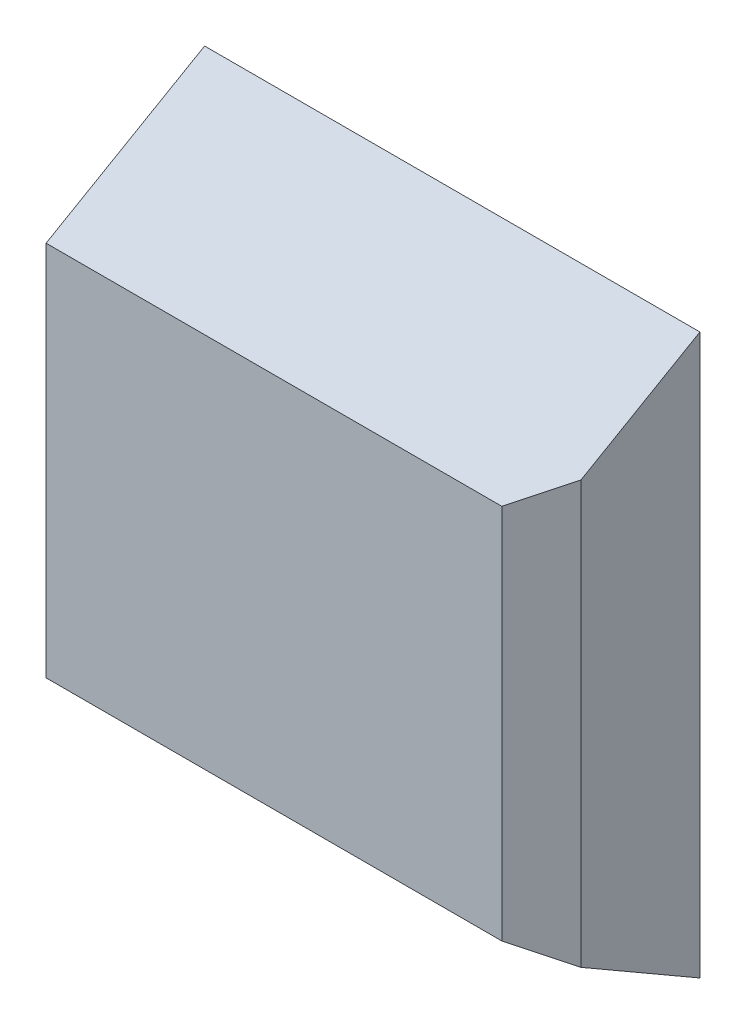
ISO-10303-21;
HEADER;
FILE_DESCRIPTION(('STEP AP214'),'2;1');
FILE_NAME('part.step','',(''),(''),'','','');
FILE_SCHEMA(('AUTOMOTIVE_DESIGN { 1 0 10303 214 1 1 1 1 }'));
ENDSEC;
DATA;
#1=APPLICATION_CONTEXT('core data for automotive mechanical design processes');
#2=APPLICATION_PROTOCOL_DEFINITION('international standard','automotive_design',2000,#1);
#3=PRODUCT_CONTEXT('',#1,'mechanical');
#4=PRODUCT('Part','Part','',(#3));
#5=PRODUCT_RELATED_PRODUCT_CATEGORY('part','',(#4));
#6=PRODUCT_DEFINITION_FORMATION('','',#4);
#7=PRODUCT_DEFINITION_CONTEXT('part definition',#1,'design');
#8=PRODUCT_DEFINITION('design','',#6,#7);
#9=PRODUCT_DEFINITION_SHAPE('','',#8);
#10=(LENGTH_UNIT() NAMED_UNIT(*) SI_UNIT(.MILLI.,.METRE.));
#11=(NAMED_UNIT(*) PLANE_ANGLE_UNIT() SI_UNIT($,.RADIAN.));
#12=(NAMED_UNIT(*) SI_UNIT($,.STERADIAN.) SOLID_ANGLE_UNIT());
#13=UNCERTAINTY_MEASURE_WITH_UNIT(LENGTH_MEASURE(1.E-05),#10,'distance_accuracy_value','');
#14=(GEOMETRIC_REPRESENTATION_CONTEXT(3) GLOBAL_UNCERTAINTY_ASSIGNED_CONTEXT((#13)) GLOBAL_UNIT_ASSIGNED_CONTEXT((#10,
#11,#12)) REPRESENTATION_CONTEXT('',''));
#15=CARTESIAN_POINT('',(0.,0.,0.));
#16=DIRECTION('',(0.,0.,1.));
#17=DIRECTION('',(1.,0.,0.));
#18=AXIS2_PLACEMENT_3D('',#15,#16,#17);
#19=CARTESIAN_POINT('',(12.5,14.118802153517,0.));
#20=DIRECTION('',(0.,0.86602540378444,0.499999999999997));
#21=DIRECTION('',(0.,-0.499999999999997,0.86602540378444));
#22=AXIS2_PLACEMENT_3D('',#19,#20,#21);
#23=PLANE('',#22);
#24=DIRECTION('',(-1.,0.,0.));
#25=VECTOR('',#24,1.);
#26=CARTESIAN_POINT('',(0.,11.8094010767585,4.));
#27=LINE('',#26,#25);
#28=CARTESIAN_POINT('',(11.5,11.8094010767585,4.));
#29=VERTEX_POINT('',#28);
#30=CARTESIAN_POINT('',(0.,11.8094010767585,4.));
#31=VERTEX_POINT('',#30);
#32=EDGE_CURVE('E115',#29,#31,#27,.T.);
#33=ORIENTED_EDGE('',*,*,#32,.F.);
#34=DIRECTION('',(-0.654653670707975,-0.377964473009226,0.65465367070798));
#35=VECTOR('',#34,1.);
#36=CARTESIAN_POINT('',(14.2142857142857,13.3764946645589,1.28571428571427));
#37=LINE('',#36,#35);
#38=CARTESIAN_POINT('',(12.5,12.3867513459481,2.99999999999999));
#39=VERTEX_POINT('',#38);
#40=EDGE_CURVE('E62',#29,#39,#37,.F.);
#41=ORIENTED_EDGE('',*,*,#40,.T.);
#42=DIRECTION('',(0.,-0.499999999999997,0.86602540378444));
#43=VECTOR('',#42,1.);
#44=CARTESIAN_POINT('',(12.5,10.5891016151378,6.11362066797605));
#45=LINE('',#44,#43);
#46=CARTESIAN_POINT('',(12.5,14.118802153517,0.));
#47=VERTEX_POINT('',#46);
#48=EDGE_CURVE('E106',#47,#39,#45,.T.);
#49=ORIENTED_EDGE('',*,*,#48,.F.);
#50=DIRECTION('',(-1.,0.,0.));
#51=VECTOR('',#50,1.);
#52=CARTESIAN_POINT('',(12.5,14.118802153517,0.));
#53=LINE('',#52,#51);
#54=CARTESIAN_POINT('',(0.,14.118802153517,0.));
#55=VERTEX_POINT('',#54);
#56=EDGE_CURVE('E101',#47,#55,#53,.T.);
#57=ORIENTED_EDGE('',*,*,#56,.T.);
#58=DIRECTION('',(0.,-0.499999999999997,0.86602540378444));
#59=VECTOR('',#58,1.);
#60=CARTESIAN_POINT('',(0.,14.118802153517,0.));
#61=LINE('',#60,#59);
#62=EDGE_CURVE('E86',#55,#31,#61,.T.);
#63=ORIENTED_EDGE('',*,*,#62,.T.);
#64=EDGE_LOOP('',(#33,#41,#49,#57,#63));
#65=FACE_BOUND('',#64,.T.);
#66=ADVANCED_FACE('F39',(#65),#23,.T.);
#67=CARTESIAN_POINT('',(12.5,0.,0.));
#68=DIRECTION('',(1.,0.,0.));
#69=DIRECTION('',(0.,0.,-1.));
#70=AXIS2_PLACEMENT_3D('',#67,#68,#69);
#71=PLANE('',#70);
#72=ORIENTED_EDGE('',*,*,#48,.T.);
#73=DIRECTION('',(0.,-1.,0.));
#74=VECTOR('',#73,1.);
#75=CARTESIAN_POINT('',(12.5,0.,2.99999999999999));
#76=LINE('',#75,#74);
#77=CARTESIAN_POINT('',(12.5,1.73205080756886,2.99999999999999));
#78=VERTEX_POINT('',#77);
#79=EDGE_CURVE('E48',#39,#78,#76,.T.);
#80=ORIENTED_EDGE('',*,*,#79,.T.);
#81=DIRECTION('',(0.,0.499999999999997,0.86602540378444));
#82=VECTOR('',#81,1.);
#83=CARTESIAN_POINT('',(12.5,0.,0.));
#84=LINE('',#83,#82);
#85=CARTESIAN_POINT('',(12.5,0.,0.));
#86=VERTEX_POINT('',#85);
#87=EDGE_CURVE('E118',#86,#78,#84,.T.);
#88=ORIENTED_EDGE('',*,*,#87,.F.);
#89=DIRECTION('',(0.,1.,0.));
#90=VECTOR('',#89,1.);
#91=CARTESIAN_POINT('',(12.5,0.,0.));
#92=LINE('',#91,#90);
#93=EDGE_CURVE('E94',#86,#47,#92,.T.);
#94=ORIENTED_EDGE('',*,*,#93,.T.);
#95=EDGE_LOOP('',(#72,#80,#88,#94));
#96=FACE_BOUND('',#95,.T.);
#97=ADVANCED_FACE('F132',(#96),#71,.T.);
#98=CARTESIAN_POINT('',(0.,0.,0.));
#99=DIRECTION('',(0.,-0.86602540378444,0.499999999999997));
#100=DIRECTION('',(0.,-0.499999999999997,-0.86602540378444));
#101=AXIS2_PLACEMENT_3D('',#98,#99,#100);
#102=PLANE('',#101);
#103=ORIENTED_EDGE('',*,*,#87,.T.);
#104=DIRECTION('',(0.654653670707975,-0.377964473009226,-0.65465367070798));
#105=VECTOR('',#104,1.);
#106=CARTESIAN_POINT('',(8.85714285714289,3.83525535961676,6.64285714285714));
#107=LINE('',#106,#105);
#108=CARTESIAN_POINT('',(11.5,2.30940107675848,4.));
#109=VERTEX_POINT('',#108);
#110=EDGE_CURVE('E11',#78,#109,#107,.F.);
#111=ORIENTED_EDGE('',*,*,#110,.T.);
#112=DIRECTION('',(1.,0.,0.));
#113=VECTOR('',#112,1.);
#114=CARTESIAN_POINT('',(0.,2.30940107675848,4.));
#115=LINE('',#114,#113);
#116=CARTESIAN_POINT('',(0.,2.30940107675848,4.));
#117=VERTEX_POINT('',#116);
#118=EDGE_CURVE('E107',#117,#109,#115,.T.);
#119=ORIENTED_EDGE('',*,*,#118,.F.);
#120=DIRECTION('',(0.,0.499999999999997,0.86602540378444));
#121=VECTOR('',#120,1.);
#122=CARTESIAN_POINT('',(0.,3.52970053837921,6.11362066797605));
#123=LINE('',#122,#121);
#124=CARTESIAN_POINT('',(0.,0.,0.));
#125=VERTEX_POINT('',#124);
#126=EDGE_CURVE('E93',#125,#117,#123,.T.);
#127=ORIENTED_EDGE('',*,*,#126,.F.);
#128=DIRECTION('',(1.,0.,0.));
#129=VECTOR('',#128,1.);
#130=CARTESIAN_POINT('',(0.,0.,0.));
#131=LINE('',#130,#129);
#132=EDGE_CURVE('E104',#125,#86,#131,.T.);
#133=ORIENTED_EDGE('',*,*,#132,.T.);
#134=EDGE_LOOP('',(#103,#111,#119,#127,#133));
#135=FACE_BOUND('',#134,.T.);
#136=ADVANCED_FACE('F131',(#135),#102,.T.);
#137=CARTESIAN_POINT('',(0.,14.118802153517,0.));
#138=DIRECTION('',(-1.,0.,0.));
#139=DIRECTION('',(0.,0.,1.));
#140=AXIS2_PLACEMENT_3D('',#137,#138,#139);
#141=PLANE('',#140);
#142=DIRECTION('',(0.,-1.,0.));
#143=VECTOR('',#142,1.);
#144=CARTESIAN_POINT('',(0.,14.118802153517,4.));
#145=LINE('',#144,#143);
#146=EDGE_CURVE('E91',#31,#117,#145,.T.);
#147=ORIENTED_EDGE('',*,*,#146,.F.);
#148=ORIENTED_EDGE('',*,*,#62,.F.);
#149=DIRECTION('',(0.,-1.,0.));
#150=VECTOR('',#149,1.);
#151=CARTESIAN_POINT('',(0.,14.118802153517,0.));
#152=LINE('',#151,#150);
#153=EDGE_CURVE('E89',#55,#125,#152,.T.);
#154=ORIENTED_EDGE('',*,*,#153,.T.);
#155=ORIENTED_EDGE('',*,*,#126,.T.);
#156=EDGE_LOOP('',(#147,#148,#154,#155));
#157=FACE_BOUND('',#156,.T.);
#158=ADVANCED_FACE('F88',(#157),#141,.T.);
#159=CARTESIAN_POINT('',(0.,0.,0.));
#160=DIRECTION('',(0.,0.,1.));
#161=DIRECTION('',(1.,0.,0.));
#162=AXIS2_PLACEMENT_3D('',#159,#160,#161);
#163=PLANE('',#162);
#164=ORIENTED_EDGE('',*,*,#56,.F.);
#165=ORIENTED_EDGE('',*,*,#93,.F.);
#166=ORIENTED_EDGE('',*,*,#132,.F.);
#167=ORIENTED_EDGE('',*,*,#153,.F.);
#168=EDGE_LOOP('',(#164,#165,#166,#167));
#169=FACE_BOUND('',#168,.T.);
#170=ADVANCED_FACE('F99',(#169),#163,.F.);
#171=CARTESIAN_POINT('',(0.,0.,4.));
#172=DIRECTION('',(0.,0.,1.));
#173=DIRECTION('',(1.,0.,0.));
#174=AXIS2_PLACEMENT_3D('',#171,#172,#173);
#175=PLANE('',#174);
#176=ORIENTED_EDGE('',*,*,#118,.T.);
#177=DIRECTION('',(0.,1.,0.));
#178=VECTOR('',#177,1.);
#179=CARTESIAN_POINT('',(11.5,0.,4.));
#180=LINE('',#179,#178);
#181=EDGE_CURVE('E117',#109,#29,#180,.T.);
#182=ORIENTED_EDGE('',*,*,#181,.T.);
#183=ORIENTED_EDGE('',*,*,#32,.T.);
#184=ORIENTED_EDGE('',*,*,#146,.T.);
#185=EDGE_LOOP('',(#176,#182,#183,#184));
#186=FACE_BOUND('',#185,.T.);
#187=ADVANCED_FACE('F126',(#186),#175,.T.);
#188=CARTESIAN_POINT('',(11.5,0.,4.));
#189=DIRECTION('',(-0.70710678118655,0.,-0.707106781186544));
#190=DIRECTION('',(0.,1.,0.));
#191=AXIS2_PLACEMENT_3D('',#188,#189,#190);
#192=PLANE('',#191);
#193=ORIENTED_EDGE('',*,*,#110,.F.);
#194=ORIENTED_EDGE('',*,*,#79,.F.);
#195=ORIENTED_EDGE('',*,*,#40,.F.);
#196=ORIENTED_EDGE('',*,*,#181,.F.);
#197=EDGE_LOOP('',(#193,#194,#195,#196));
#198=FACE_BOUND('',#197,.T.);
#199=ADVANCED_FACE('F42',(#198),#192,.F.);
#200=CLOSED_SHELL('',(#66,#97,#136,#158,#170,#187,#199));
#201=MANIFOLD_SOLID_BREP('B2',#200);
#202=ADVANCED_BREP_SHAPE_REPRESENTATION('',(#18,#201),#14);
#203=SHAPE_DEFINITION_REPRESENTATION(#9,#202);
ENDSEC;
END-ISO-10303-21;
